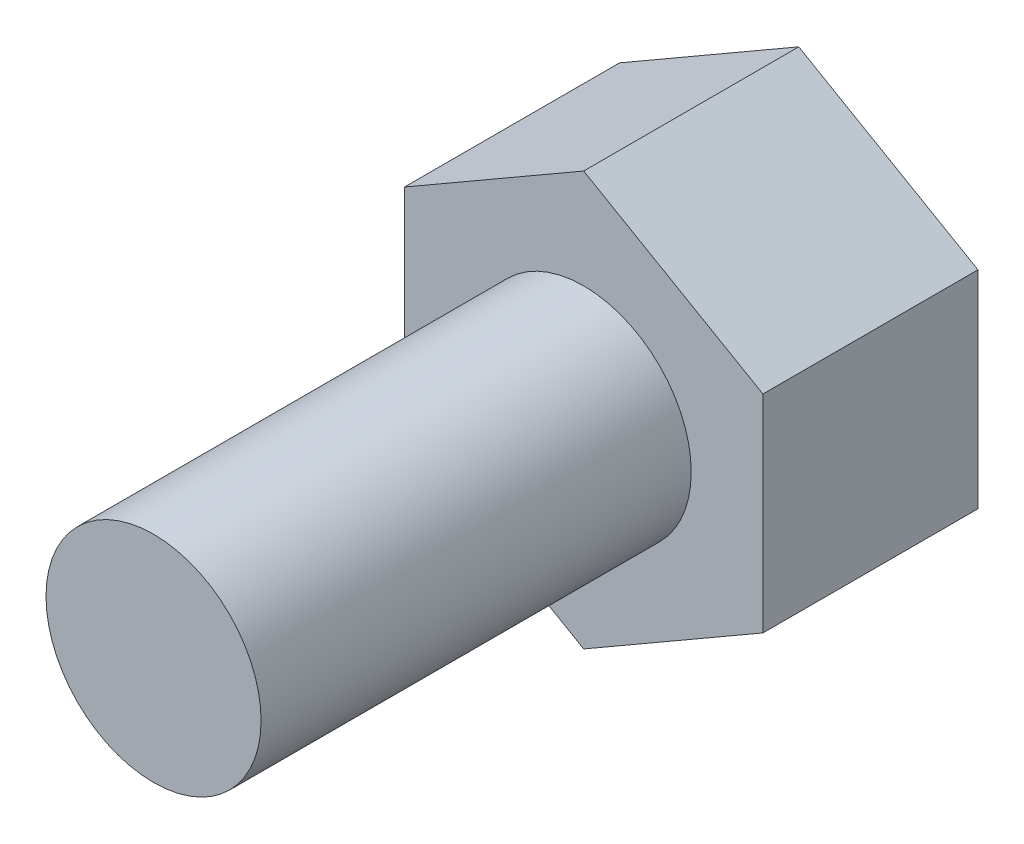
ISO-10303-21;
HEADER;
FILE_DESCRIPTION(('STEP AP214'),'2;1');
FILE_NAME('part.step','',(''),(''),'','','');
FILE_SCHEMA(('AUTOMOTIVE_DESIGN { 1 0 10303 214 1 1 1 1 }'));
ENDSEC;
DATA;
#1=APPLICATION_CONTEXT('core data for automotive mechanical design processes');
#2=APPLICATION_PROTOCOL_DEFINITION('international standard','automotive_design',2000,#1);
#3=PRODUCT_CONTEXT('',#1,'mechanical');
#4=PRODUCT('Part','Part','',(#3));
#5=PRODUCT_RELATED_PRODUCT_CATEGORY('part','',(#4));
#6=PRODUCT_DEFINITION_FORMATION('','',#4);
#7=PRODUCT_DEFINITION_CONTEXT('part definition',#1,'design');
#8=PRODUCT_DEFINITION('design','',#6,#7);
#9=PRODUCT_DEFINITION_SHAPE('','',#8);
#10=(LENGTH_UNIT() NAMED_UNIT(*) SI_UNIT(.MILLI.,.METRE.));
#11=(NAMED_UNIT(*) PLANE_ANGLE_UNIT() SI_UNIT($,.RADIAN.));
#12=(NAMED_UNIT(*) SI_UNIT($,.STERADIAN.) SOLID_ANGLE_UNIT());
#13=UNCERTAINTY_MEASURE_WITH_UNIT(LENGTH_MEASURE(1.E-05),#10,'distance_accuracy_value','');
#14=(GEOMETRIC_REPRESENTATION_CONTEXT(3) GLOBAL_UNCERTAINTY_ASSIGNED_CONTEXT((#13)) GLOBAL_UNIT_ASSIGNED_CONTEXT((#10,
#11,#12)) REPRESENTATION_CONTEXT('',''));
#15=CARTESIAN_POINT('',(0.,0.,0.));
#16=DIRECTION('',(0.,0.,1.));
#17=DIRECTION('',(1.,0.,0.));
#18=AXIS2_PLACEMENT_3D('',#15,#16,#17);
#19=CARTESIAN_POINT('',(-63.4947615904966,14.9787081339713,6.));
#20=DIRECTION('',(0.,0.,-1.));
#21=DIRECTION('',(-1.,0.,0.));
#22=AXIS2_PLACEMENT_3D('',#19,#20,#21);
#23=CYLINDRICAL_SURFACE('',#22,1.5);
#24=CARTESIAN_POINT('',(-63.4947615904966,14.9787081339713,6.));
#25=DIRECTION('',(0.,0.,1.));
#26=DIRECTION('',(1.,0.,0.));
#27=AXIS2_PLACEMENT_3D('',#24,#25,#26);
#28=CIRCLE('',#27,1.5);
#29=CARTESIAN_POINT('',(-61.9947615904966,14.9787081339713,6.));
#30=VERTEX_POINT('',#29);
#31=EDGE_CURVE('E11',#30,#30,#28,.T.);
#32=ORIENTED_EDGE('',*,*,#31,.F.);
#33=EDGE_LOOP('',(#32));
#34=FACE_BOUND('',#33,.T.);
#35=CARTESIAN_POINT('',(-63.4947615904966,14.9787081339713,0.));
#36=DIRECTION('',(0.,0.,-1.));
#37=DIRECTION('',(-1.,0.,0.));
#38=AXIS2_PLACEMENT_3D('',#35,#36,#37);
#39=CIRCLE('',#38,1.5);
#40=CARTESIAN_POINT('',(-64.9947615904966,14.9787081339713,0.));
#41=VERTEX_POINT('',#40);
#42=EDGE_CURVE('E40',#41,#41,#39,.T.);
#43=ORIENTED_EDGE('',*,*,#42,.F.);
#44=EDGE_LOOP('',(#43));
#45=FACE_BOUND('',#44,.T.);
#46=ADVANCED_FACE('F32',(#34,#45),#23,.T.);
#47=CARTESIAN_POINT('',(-63.4947615904966,14.9787081339713,6.));
#48=DIRECTION('',(0.,0.,1.));
#49=DIRECTION('',(1.,0.,0.));
#50=AXIS2_PLACEMENT_3D('',#47,#48,#49);
#51=PLANE('',#50);
#52=ORIENTED_EDGE('',*,*,#31,.T.);
#53=EDGE_LOOP('',(#52));
#54=FACE_BOUND('',#53,.T.);
#55=ADVANCED_FACE('F142',(#54),#51,.T.);
#56=CARTESIAN_POINT('',(-60.9947615904966,13.5353324609972,-3.));
#57=DIRECTION('',(-0.5,0.866025403784439,0.));
#58=DIRECTION('',(-0.866025403784439,-0.5,0.));
#59=AXIS2_PLACEMENT_3D('',#56,#57,#58);
#60=PLANE('',#59);
#61=DIRECTION('',(-0.866025403784439,-0.5,0.));
#62=VECTOR('',#61,1.);
#63=CARTESIAN_POINT('',(-60.9947615904966,13.5353324609972,0.));
#64=LINE('',#63,#62);
#65=CARTESIAN_POINT('',(-60.9947615904966,13.5353324609972,0.));
#66=VERTEX_POINT('',#65);
#67=CARTESIAN_POINT('',(-63.4947615904967,12.0919567880232,0.));
#68=VERTEX_POINT('',#67);
#69=EDGE_CURVE('E117',#66,#68,#64,.T.);
#70=ORIENTED_EDGE('',*,*,#69,.T.);
#71=DIRECTION('',(0.,0.,1.));
#72=VECTOR('',#71,1.);
#73=CARTESIAN_POINT('',(-63.4947615904967,12.0919567880232,-3.));
#74=LINE('',#73,#72);
#75=CARTESIAN_POINT('',(-63.4947615904967,12.0919567880232,-3.));
#76=VERTEX_POINT('',#75);
#77=EDGE_CURVE('E134',#76,#68,#74,.T.);
#78=ORIENTED_EDGE('',*,*,#77,.F.);
#79=DIRECTION('',(-0.866025403784439,-0.5,0.));
#80=VECTOR('',#79,1.);
#81=CARTESIAN_POINT('',(-60.9947615904966,13.5353324609972,-3.));
#82=LINE('',#81,#80);
#83=CARTESIAN_POINT('',(-60.9947615904966,13.5353324609972,-3.));
#84=VERTEX_POINT('',#83);
#85=EDGE_CURVE('E127',#84,#76,#82,.T.);
#86=ORIENTED_EDGE('',*,*,#85,.F.);
#87=DIRECTION('',(0.,0.,1.));
#88=VECTOR('',#87,1.);
#89=CARTESIAN_POINT('',(-60.9947615904966,13.5353324609972,-3.));
#90=LINE('',#89,#88);
#91=EDGE_CURVE('E113',#84,#66,#90,.T.);
#92=ORIENTED_EDGE('',*,*,#91,.T.);
#93=EDGE_LOOP('',(#70,#78,#86,#92));
#94=FACE_BOUND('',#93,.T.);
#95=ADVANCED_FACE('F147',(#94),#60,.F.);
#96=CARTESIAN_POINT('',(-63.4947615904967,12.0919567880232,-3.));
#97=DIRECTION('',(0.5,0.866025403784438,0.));
#98=DIRECTION('',(-0.866025403784438,0.5,0.));
#99=AXIS2_PLACEMENT_3D('',#96,#97,#98);
#100=PLANE('',#99);
#101=DIRECTION('',(-0.866025403784438,0.5,0.));
#102=VECTOR('',#101,1.);
#103=CARTESIAN_POINT('',(-63.4947615904967,12.0919567880232,0.));
#104=LINE('',#103,#102);
#105=CARTESIAN_POINT('',(-65.9947615904966,13.5353324609972,0.));
#106=VERTEX_POINT('',#105);
#107=EDGE_CURVE('E120',#68,#106,#104,.T.);
#108=ORIENTED_EDGE('',*,*,#107,.T.);
#109=DIRECTION('',(0.,0.,1.));
#110=VECTOR('',#109,1.);
#111=CARTESIAN_POINT('',(-65.9947615904966,13.5353324609972,-3.));
#112=LINE('',#111,#110);
#113=CARTESIAN_POINT('',(-65.9947615904966,13.5353324609972,-3.));
#114=VERTEX_POINT('',#113);
#115=EDGE_CURVE('E131',#114,#106,#112,.T.);
#116=ORIENTED_EDGE('',*,*,#115,.F.);
#117=DIRECTION('',(-0.866025403784438,0.5,0.));
#118=VECTOR('',#117,1.);
#119=CARTESIAN_POINT('',(-63.4947615904967,12.0919567880232,-3.));
#120=LINE('',#119,#118);
#121=EDGE_CURVE('E86',#76,#114,#120,.T.);
#122=ORIENTED_EDGE('',*,*,#121,.F.);
#123=ORIENTED_EDGE('',*,*,#77,.T.);
#124=EDGE_LOOP('',(#108,#116,#122,#123));
#125=FACE_BOUND('',#124,.T.);
#126=ADVANCED_FACE('F153',(#125),#100,.F.);
#127=CARTESIAN_POINT('',(-65.9947615904966,13.5353324609972,-3.));
#128=DIRECTION('',(1.,0.,0.));
#129=DIRECTION('',(0.,0.,-1.));
#130=AXIS2_PLACEMENT_3D('',#127,#128,#129);
#131=PLANE('',#130);
#132=DIRECTION('',(0.,1.,0.));
#133=VECTOR('',#132,1.);
#134=CARTESIAN_POINT('',(-65.9947615904966,13.5353324609972,0.));
#135=LINE('',#134,#133);
#136=CARTESIAN_POINT('',(-65.9947615904966,16.4220838069454,0.));
#137=VERTEX_POINT('',#136);
#138=EDGE_CURVE('E122',#106,#137,#135,.T.);
#139=ORIENTED_EDGE('',*,*,#138,.T.);
#140=DIRECTION('',(0.,0.,1.));
#141=VECTOR('',#140,1.);
#142=CARTESIAN_POINT('',(-65.9947615904966,16.4220838069454,-3.));
#143=LINE('',#142,#141);
#144=CARTESIAN_POINT('',(-65.9947615904966,16.4220838069454,-3.));
#145=VERTEX_POINT('',#144);
#146=EDGE_CURVE('E108',#145,#137,#143,.T.);
#147=ORIENTED_EDGE('',*,*,#146,.F.);
#148=DIRECTION('',(0.,1.,0.));
#149=VECTOR('',#148,1.);
#150=CARTESIAN_POINT('',(-65.9947615904966,13.5353324609972,-3.));
#151=LINE('',#150,#149);
#152=EDGE_CURVE('E99',#114,#145,#151,.T.);
#153=ORIENTED_EDGE('',*,*,#152,.F.);
#154=ORIENTED_EDGE('',*,*,#115,.T.);
#155=EDGE_LOOP('',(#139,#147,#153,#154));
#156=FACE_BOUND('',#155,.T.);
#157=ADVANCED_FACE('F159',(#156),#131,.F.);
#158=CARTESIAN_POINT('',(-65.9947615904966,16.4220838069454,-3.));
#159=DIRECTION('',(0.499999999999999,-0.866025403784439,0.));
#160=DIRECTION('',(0.866025403784439,0.499999999999999,0.));
#161=AXIS2_PLACEMENT_3D('',#158,#159,#160);
#162=PLANE('',#161);
#163=DIRECTION('',(0.866025403784439,0.499999999999999,0.));
#164=VECTOR('',#163,1.);
#165=CARTESIAN_POINT('',(-65.9947615904966,16.4220838069454,0.));
#166=LINE('',#165,#164);
#167=CARTESIAN_POINT('',(-63.4947615904966,17.8654594799194,0.));
#168=VERTEX_POINT('',#167);
#169=EDGE_CURVE('E107',#137,#168,#166,.T.);
#170=ORIENTED_EDGE('',*,*,#169,.T.);
#171=DIRECTION('',(0.,0.,1.));
#172=VECTOR('',#171,1.);
#173=CARTESIAN_POINT('',(-63.4947615904966,17.8654594799194,-3.));
#174=LINE('',#173,#172);
#175=CARTESIAN_POINT('',(-63.4947615904966,17.8654594799194,-3.));
#176=VERTEX_POINT('',#175);
#177=EDGE_CURVE('E104',#176,#168,#174,.T.);
#178=ORIENTED_EDGE('',*,*,#177,.F.);
#179=DIRECTION('',(0.866025403784439,0.499999999999999,0.));
#180=VECTOR('',#179,1.);
#181=CARTESIAN_POINT('',(-65.9947615904966,16.4220838069454,-3.));
#182=LINE('',#181,#180);
#183=EDGE_CURVE('E93',#145,#176,#182,.T.);
#184=ORIENTED_EDGE('',*,*,#183,.F.);
#185=ORIENTED_EDGE('',*,*,#146,.T.);
#186=EDGE_LOOP('',(#170,#178,#184,#185));
#187=FACE_BOUND('',#186,.T.);
#188=ADVANCED_FACE('F105',(#187),#162,.F.);
#189=CARTESIAN_POINT('',(-63.4947615904966,17.8654594799194,-3.));
#190=DIRECTION('',(-0.500000000000001,-0.866025403784438,0.));
#191=DIRECTION('',(0.866025403784438,-0.500000000000001,0.));
#192=AXIS2_PLACEMENT_3D('',#189,#190,#191);
#193=PLANE('',#192);
#194=DIRECTION('',(0.866025403784438,-0.500000000000001,0.));
#195=VECTOR('',#194,1.);
#196=CARTESIAN_POINT('',(-63.4947615904966,17.8654594799194,0.));
#197=LINE('',#196,#195);
#198=CARTESIAN_POINT('',(-60.9947615904966,16.4220838069454,0.));
#199=VERTEX_POINT('',#198);
#200=EDGE_CURVE('E71',#168,#199,#197,.T.);
#201=ORIENTED_EDGE('',*,*,#200,.T.);
#202=DIRECTION('',(0.,0.,1.));
#203=VECTOR('',#202,1.);
#204=CARTESIAN_POINT('',(-60.9947615904966,16.4220838069454,-3.));
#205=LINE('',#204,#203);
#206=CARTESIAN_POINT('',(-60.9947615904966,16.4220838069454,-3.));
#207=VERTEX_POINT('',#206);
#208=EDGE_CURVE('E109',#207,#199,#205,.T.);
#209=ORIENTED_EDGE('',*,*,#208,.F.);
#210=DIRECTION('',(0.866025403784438,-0.500000000000001,0.));
#211=VECTOR('',#210,1.);
#212=CARTESIAN_POINT('',(-63.4947615904966,17.8654594799194,-3.));
#213=LINE('',#212,#211);
#214=EDGE_CURVE('E97',#176,#207,#213,.T.);
#215=ORIENTED_EDGE('',*,*,#214,.F.);
#216=ORIENTED_EDGE('',*,*,#177,.T.);
#217=EDGE_LOOP('',(#201,#209,#215,#216));
#218=FACE_BOUND('',#217,.T.);
#219=ADVANCED_FACE('F111',(#218),#193,.F.);
#220=CARTESIAN_POINT('',(-60.9947615904966,16.4220838069454,-3.));
#221=DIRECTION('',(-1.,0.,0.));
#222=DIRECTION('',(0.,0.,1.));
#223=AXIS2_PLACEMENT_3D('',#220,#221,#222);
#224=PLANE('',#223);
#225=DIRECTION('',(0.,-1.,0.));
#226=VECTOR('',#225,1.);
#227=CARTESIAN_POINT('',(-60.9947615904966,16.4220838069454,0.));
#228=LINE('',#227,#226);
#229=EDGE_CURVE('E77',#199,#66,#228,.T.);
#230=ORIENTED_EDGE('',*,*,#229,.T.);
#231=ORIENTED_EDGE('',*,*,#91,.F.);
#232=DIRECTION('',(0.,-1.,0.));
#233=VECTOR('',#232,1.);
#234=CARTESIAN_POINT('',(-60.9947615904966,16.4220838069454,-3.));
#235=LINE('',#234,#233);
#236=EDGE_CURVE('E48',#207,#84,#235,.T.);
#237=ORIENTED_EDGE('',*,*,#236,.F.);
#238=ORIENTED_EDGE('',*,*,#208,.T.);
#239=EDGE_LOOP('',(#230,#231,#237,#238));
#240=FACE_BOUND('',#239,.T.);
#241=ADVANCED_FACE('F167',(#240),#224,.F.);
#242=CARTESIAN_POINT('',(0.,0.,-3.));
#243=DIRECTION('',(0.,0.,-1.));
#244=DIRECTION('',(-1.,0.,0.));
#245=AXIS2_PLACEMENT_3D('',#242,#243,#244);
#246=PLANE('',#245);
#247=ORIENTED_EDGE('',*,*,#85,.T.);
#248=ORIENTED_EDGE('',*,*,#121,.T.);
#249=ORIENTED_EDGE('',*,*,#152,.T.);
#250=ORIENTED_EDGE('',*,*,#183,.T.);
#251=ORIENTED_EDGE('',*,*,#214,.T.);
#252=ORIENTED_EDGE('',*,*,#236,.T.);
#253=EDGE_LOOP('',(#247,#248,#249,#250,#251,#252));
#254=FACE_BOUND('',#253,.T.);
#255=ADVANCED_FACE('F95',(#254),#246,.T.);
#256=CARTESIAN_POINT('',(0.,0.,0.));
#257=DIRECTION('',(0.,0.,-1.));
#258=DIRECTION('',(-1.,0.,0.));
#259=AXIS2_PLACEMENT_3D('',#256,#257,#258);
#260=PLANE('',#259);
#261=ORIENTED_EDGE('',*,*,#42,.T.);
#262=EDGE_LOOP('',(#261));
#263=FACE_BOUND('',#262,.T.);
#264=ORIENTED_EDGE('',*,*,#69,.F.);
#265=ORIENTED_EDGE('',*,*,#229,.F.);
#266=ORIENTED_EDGE('',*,*,#200,.F.);
#267=ORIENTED_EDGE('',*,*,#169,.F.);
#268=ORIENTED_EDGE('',*,*,#138,.F.);
#269=ORIENTED_EDGE('',*,*,#107,.F.);
#270=EDGE_LOOP('',(#264,#265,#266,#267,#268,#269));
#271=FACE_BOUND('',#270,.T.);
#272=ADVANCED_FACE('F138',(#263,#271),#260,.F.);
#273=CLOSED_SHELL('',(#46,#55,#95,#126,#157,#188,#219,#241,#255,#272));
#274=MANIFOLD_SOLID_BREP('B2',#273);
#275=ADVANCED_BREP_SHAPE_REPRESENTATION('',(#18,#274),#14);
#276=SHAPE_DEFINITION_REPRESENTATION(#9,#275);
ENDSEC;
END-ISO-10303-21;
